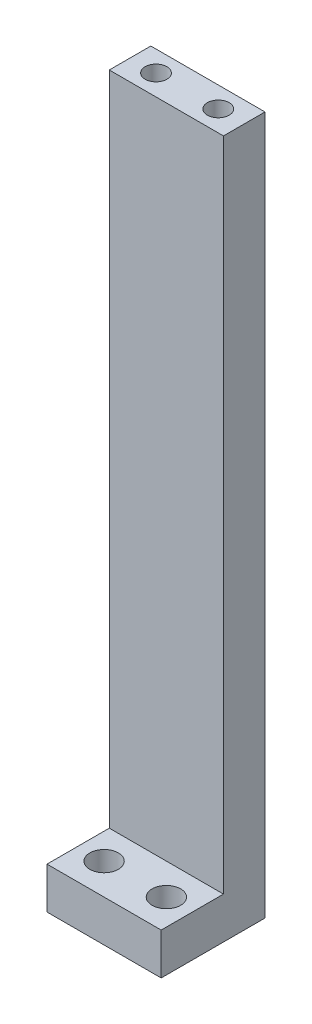
ISO-10303-21;
HEADER;
FILE_DESCRIPTION(('STEP AP214'),'2;1');
FILE_NAME('part.step','',(''),(''),'','','');
FILE_SCHEMA(('AUTOMOTIVE_DESIGN { 1 0 10303 214 1 1 1 1 }'));
ENDSEC;
DATA;
#1=APPLICATION_CONTEXT('core data for automotive mechanical design processes');
#2=APPLICATION_PROTOCOL_DEFINITION('international standard','automotive_design',2000,#1);
#3=PRODUCT_CONTEXT('',#1,'mechanical');
#4=PRODUCT('Part','Part','',(#3));
#5=PRODUCT_RELATED_PRODUCT_CATEGORY('part','',(#4));
#6=PRODUCT_DEFINITION_FORMATION('','',#4);
#7=PRODUCT_DEFINITION_CONTEXT('part definition',#1,'design');
#8=PRODUCT_DEFINITION('design','',#6,#7);
#9=PRODUCT_DEFINITION_SHAPE('','',#8);
#10=(LENGTH_UNIT() NAMED_UNIT(*) SI_UNIT(.MILLI.,.METRE.));
#11=(NAMED_UNIT(*) PLANE_ANGLE_UNIT() SI_UNIT($,.RADIAN.));
#12=(NAMED_UNIT(*) SI_UNIT($,.STERADIAN.) SOLID_ANGLE_UNIT());
#13=UNCERTAINTY_MEASURE_WITH_UNIT(LENGTH_MEASURE(1.E-05),#10,'distance_accuracy_value','');
#14=(GEOMETRIC_REPRESENTATION_CONTEXT(3) GLOBAL_UNCERTAINTY_ASSIGNED_CONTEXT((#13)) GLOBAL_UNIT_ASSIGNED_CONTEXT((#10,
#11,#12)) REPRESENTATION_CONTEXT('',''));
#15=CARTESIAN_POINT('',(0.,0.,0.));
#16=DIRECTION('',(0.,0.,1.));
#17=DIRECTION('',(1.,0.,0.));
#18=AXIS2_PLACEMENT_3D('',#15,#16,#17);
#19=CARTESIAN_POINT('',(0.,0.,8.));
#20=DIRECTION('',(0.,0.,-1.));
#21=DIRECTION('',(-1.,0.,0.));
#22=AXIS2_PLACEMENT_3D('',#19,#20,#21);
#23=PLANE('',#22);
#24=DIRECTION('',(-1.,0.,0.));
#25=VECTOR('',#24,1.);
#26=CARTESIAN_POINT('',(0.,8.,8.));
#27=LINE('',#26,#25);
#28=CARTESIAN_POINT('',(22.,8.,8.));
#29=VERTEX_POINT('',#28);
#30=CARTESIAN_POINT('',(0.,8.,8.));
#31=VERTEX_POINT('',#30);
#32=EDGE_CURVE('E54',#29,#31,#27,.T.);
#33=ORIENTED_EDGE('',*,*,#32,.F.);
#34=DIRECTION('',(0.,1.,0.));
#35=VECTOR('',#34,1.);
#36=CARTESIAN_POINT('',(22.,0.,8.));
#37=LINE('',#36,#35);
#38=CARTESIAN_POINT('',(22.,134.5,8.));
#39=VERTEX_POINT('',#38);
#40=EDGE_CURVE('E155',#29,#39,#37,.T.);
#41=ORIENTED_EDGE('',*,*,#40,.T.);
#42=DIRECTION('',(-1.,0.,0.));
#43=VECTOR('',#42,1.);
#44=CARTESIAN_POINT('',(0.,134.5,8.));
#45=LINE('',#44,#43);
#46=CARTESIAN_POINT('',(0.,134.5,8.));
#47=VERTEX_POINT('',#46);
#48=EDGE_CURVE('E60',#39,#47,#45,.T.);
#49=ORIENTED_EDGE('',*,*,#48,.T.);
#50=DIRECTION('',(0.,-1.,0.));
#51=VECTOR('',#50,1.);
#52=CARTESIAN_POINT('',(0.,0.,8.));
#53=LINE('',#52,#51);
#54=EDGE_CURVE('E89',#47,#31,#53,.T.);
#55=ORIENTED_EDGE('',*,*,#54,.T.);
#56=EDGE_LOOP('',(#33,#41,#49,#55));
#57=FACE_BOUND('',#56,.T.);
#58=ADVANCED_FACE('F39',(#57),#23,.F.);
#59=CARTESIAN_POINT('',(0.,0.,8.));
#60=DIRECTION('',(1.,0.,0.));
#61=DIRECTION('',(0.,0.,-1.));
#62=AXIS2_PLACEMENT_3D('',#59,#60,#61);
#63=PLANE('',#62);
#64=DIRECTION('',(0.,-1.,0.));
#65=VECTOR('',#64,1.);
#66=CARTESIAN_POINT('',(0.,0.,0.));
#67=LINE('',#66,#65);
#68=CARTESIAN_POINT('',(0.,134.5,0.));
#69=VERTEX_POINT('',#68);
#70=CARTESIAN_POINT('',(0.,0.,0.));
#71=VERTEX_POINT('',#70);
#72=EDGE_CURVE('E95',#69,#71,#67,.T.);
#73=ORIENTED_EDGE('',*,*,#72,.T.);
#74=DIRECTION('',(0.,0.,-1.));
#75=VECTOR('',#74,1.);
#76=CARTESIAN_POINT('',(0.,0.,8.));
#77=LINE('',#76,#75);
#78=CARTESIAN_POINT('',(0.,0.,20.));
#79=VERTEX_POINT('',#78);
#80=EDGE_CURVE('E11',#79,#71,#77,.T.);
#81=ORIENTED_EDGE('',*,*,#80,.F.);
#82=DIRECTION('',(0.,-1.,0.));
#83=VECTOR('',#82,1.);
#84=CARTESIAN_POINT('',(0.,0.,20.));
#85=LINE('',#84,#83);
#86=CARTESIAN_POINT('',(0.,8.,20.));
#87=VERTEX_POINT('',#86);
#88=EDGE_CURVE('E132',#87,#79,#85,.T.);
#89=ORIENTED_EDGE('',*,*,#88,.F.);
#90=DIRECTION('',(0.,0.,-1.));
#91=VECTOR('',#90,1.);
#92=CARTESIAN_POINT('',(0.,8.,20.));
#93=LINE('',#92,#91);
#94=EDGE_CURVE('E140',#87,#31,#93,.T.);
#95=ORIENTED_EDGE('',*,*,#94,.T.);
#96=ORIENTED_EDGE('',*,*,#54,.F.);
#97=DIRECTION('',(0.,0.,-1.));
#98=VECTOR('',#97,1.);
#99=CARTESIAN_POINT('',(0.,134.5,8.));
#100=LINE('',#99,#98);
#101=EDGE_CURVE('E82',#47,#69,#100,.T.);
#102=ORIENTED_EDGE('',*,*,#101,.T.);
#103=EDGE_LOOP('',(#73,#81,#89,#95,#96,#102));
#104=FACE_BOUND('',#103,.T.);
#105=ADVANCED_FACE('F41',(#104),#63,.F.);
#106=CARTESIAN_POINT('',(0.,0.,8.));
#107=DIRECTION('',(0.,1.,0.));
#108=DIRECTION('',(0.,0.,1.));
#109=AXIS2_PLACEMENT_3D('',#106,#107,#108);
#110=PLANE('',#109);
#111=CARTESIAN_POINT('',(17.,0.,14.));
#112=DIRECTION('',(0.,1.,0.));
#113=DIRECTION('',(0.,0.,-1.));
#114=AXIS2_PLACEMENT_3D('',#111,#112,#113);
#115=CIRCLE('',#114,2.75);
#116=CARTESIAN_POINT('',(17.,0.,11.25));
#117=VERTEX_POINT('',#116);
#118=EDGE_CURVE('E227',#117,#117,#115,.T.);
#119=ORIENTED_EDGE('',*,*,#118,.T.);
#120=EDGE_LOOP('',(#119));
#121=FACE_BOUND('',#120,.T.);
#122=CARTESIAN_POINT('',(5.,0.,14.));
#123=DIRECTION('',(0.,1.,0.));
#124=DIRECTION('',(0.,0.,1.));
#125=AXIS2_PLACEMENT_3D('',#122,#123,#124);
#126=CIRCLE('',#125,2.75);
#127=CARTESIAN_POINT('',(5.,0.,16.75));
#128=VERTEX_POINT('',#127);
#129=EDGE_CURVE('E142',#128,#128,#126,.T.);
#130=ORIENTED_EDGE('',*,*,#129,.T.);
#131=EDGE_LOOP('',(#130));
#132=FACE_BOUND('',#131,.T.);
#133=DIRECTION('',(1.,0.,0.));
#134=VECTOR('',#133,1.);
#135=CARTESIAN_POINT('',(0.,0.,0.));
#136=LINE('',#135,#134);
#137=CARTESIAN_POINT('',(22.,0.,0.));
#138=VERTEX_POINT('',#137);
#139=EDGE_CURVE('E99',#71,#138,#136,.T.);
#140=ORIENTED_EDGE('',*,*,#139,.T.);
#141=DIRECTION('',(0.,0.,-1.));
#142=VECTOR('',#141,1.);
#143=CARTESIAN_POINT('',(22.,0.,8.));
#144=LINE('',#143,#142);
#145=CARTESIAN_POINT('',(22.,0.,20.));
#146=VERTEX_POINT('',#145);
#147=EDGE_CURVE('E47',#146,#138,#144,.T.);
#148=ORIENTED_EDGE('',*,*,#147,.F.);
#149=DIRECTION('',(1.,0.,0.));
#150=VECTOR('',#149,1.);
#151=CARTESIAN_POINT('',(0.,0.,20.));
#152=LINE('',#151,#150);
#153=EDGE_CURVE('E124',#79,#146,#152,.T.);
#154=ORIENTED_EDGE('',*,*,#153,.F.);
#155=ORIENTED_EDGE('',*,*,#80,.T.);
#156=EDGE_LOOP('',(#140,#148,#154,#155));
#157=FACE_BOUND('',#156,.T.);
#158=ADVANCED_FACE('F122',(#121,#132,#157),#110,.F.);
#159=CARTESIAN_POINT('',(22.,0.,8.));
#160=DIRECTION('',(-1.,0.,0.));
#161=DIRECTION('',(0.,-1.,0.));
#162=AXIS2_PLACEMENT_3D('',#159,#160,#161);
#163=PLANE('',#162);
#164=DIRECTION('',(0.,1.,0.));
#165=VECTOR('',#164,1.);
#166=CARTESIAN_POINT('',(22.,0.,0.));
#167=LINE('',#166,#165);
#168=CARTESIAN_POINT('',(22.,134.5,0.));
#169=VERTEX_POINT('',#168);
#170=EDGE_CURVE('E90',#138,#169,#167,.T.);
#171=ORIENTED_EDGE('',*,*,#170,.T.);
#172=DIRECTION('',(0.,0.,-1.));
#173=VECTOR('',#172,1.);
#174=CARTESIAN_POINT('',(22.,134.5,8.));
#175=LINE('',#174,#173);
#176=EDGE_CURVE('E85',#39,#169,#175,.T.);
#177=ORIENTED_EDGE('',*,*,#176,.F.);
#178=ORIENTED_EDGE('',*,*,#40,.F.);
#179=DIRECTION('',(0.,0.,-1.));
#180=VECTOR('',#179,1.);
#181=CARTESIAN_POINT('',(22.,8.,20.));
#182=LINE('',#181,#180);
#183=CARTESIAN_POINT('',(22.,8.,20.));
#184=VERTEX_POINT('',#183);
#185=EDGE_CURVE('E144',#184,#29,#182,.T.);
#186=ORIENTED_EDGE('',*,*,#185,.F.);
#187=DIRECTION('',(0.,1.,0.));
#188=VECTOR('',#187,1.);
#189=CARTESIAN_POINT('',(22.,0.,20.));
#190=LINE('',#189,#188);
#191=EDGE_CURVE('E118',#146,#184,#190,.T.);
#192=ORIENTED_EDGE('',*,*,#191,.F.);
#193=ORIENTED_EDGE('',*,*,#147,.T.);
#194=EDGE_LOOP('',(#171,#177,#178,#186,#192,#193));
#195=FACE_BOUND('',#194,.T.);
#196=ADVANCED_FACE('F114',(#195),#163,.F.);
#197=CARTESIAN_POINT('',(0.,134.5,8.));
#198=DIRECTION('',(0.,-1.,0.));
#199=DIRECTION('',(0.,0.,-1.));
#200=AXIS2_PLACEMENT_3D('',#197,#198,#199);
#201=PLANE('',#200);
#202=CARTESIAN_POINT('',(17.,134.5,4.00000000000003));
#203=DIRECTION('',(0.,1.,0.));
#204=DIRECTION('',(0.,0.,1.));
#205=AXIS2_PLACEMENT_3D('',#202,#203,#204);
#206=CIRCLE('',#205,2.1);
#207=CARTESIAN_POINT('',(17.,134.5,6.10000000000003));
#208=VERTEX_POINT('',#207);
#209=EDGE_CURVE('E147',#208,#208,#206,.T.);
#210=ORIENTED_EDGE('',*,*,#209,.F.);
#211=EDGE_LOOP('',(#210));
#212=FACE_BOUND('',#211,.T.);
#213=CARTESIAN_POINT('',(4.99999999999999,134.5,4.00000000000003));
#214=DIRECTION('',(0.,1.,0.));
#215=DIRECTION('',(0.,0.,1.));
#216=AXIS2_PLACEMENT_3D('',#213,#214,#215);
#217=CIRCLE('',#216,2.1);
#218=CARTESIAN_POINT('',(4.99999999999999,134.5,6.10000000000003));
#219=VERTEX_POINT('',#218);
#220=EDGE_CURVE('E104',#219,#219,#217,.T.);
#221=ORIENTED_EDGE('',*,*,#220,.F.);
#222=EDGE_LOOP('',(#221));
#223=FACE_BOUND('',#222,.T.);
#224=DIRECTION('',(-1.,0.,0.));
#225=VECTOR('',#224,1.);
#226=CARTESIAN_POINT('',(0.,134.5,0.));
#227=LINE('',#226,#225);
#228=EDGE_CURVE('E79',#169,#69,#227,.T.);
#229=ORIENTED_EDGE('',*,*,#228,.T.);
#230=ORIENTED_EDGE('',*,*,#101,.F.);
#231=ORIENTED_EDGE('',*,*,#48,.F.);
#232=ORIENTED_EDGE('',*,*,#176,.T.);
#233=EDGE_LOOP('',(#229,#230,#231,#232));
#234=FACE_BOUND('',#233,.T.);
#235=ADVANCED_FACE('F81',(#212,#223,#234),#201,.F.);
#236=CARTESIAN_POINT('',(0.,0.,0.));
#237=DIRECTION('',(0.,0.,-1.));
#238=DIRECTION('',(-1.,0.,0.));
#239=AXIS2_PLACEMENT_3D('',#236,#237,#238);
#240=PLANE('',#239);
#241=ORIENTED_EDGE('',*,*,#72,.F.);
#242=ORIENTED_EDGE('',*,*,#228,.F.);
#243=ORIENTED_EDGE('',*,*,#170,.F.);
#244=ORIENTED_EDGE('',*,*,#139,.F.);
#245=EDGE_LOOP('',(#241,#242,#243,#244));
#246=FACE_BOUND('',#245,.T.);
#247=ADVANCED_FACE('F98',(#246),#240,.T.);
#248=CARTESIAN_POINT('',(4.99999999999999,122.1,4.00000000000003));
#249=DIRECTION('',(0.,1.,0.));
#250=DIRECTION('',(0.,0.,1.));
#251=AXIS2_PLACEMENT_3D('',#248,#249,#250);
#252=CONICAL_SURFACE('',#251,2.1,1.02974425867665);
#253=CARTESIAN_POINT('',(4.99999999999999,120.838192700042,4.00000000000003));
#254=VERTEX_POINT('',#253);
#255=VERTEX_LOOP('',#254);
#256=FACE_BOUND('',#255,.T.);
#257=CARTESIAN_POINT('',(4.99999999999999,122.1,4.00000000000003));
#258=DIRECTION('',(0.,1.,0.));
#259=DIRECTION('',(0.,0.,1.));
#260=AXIS2_PLACEMENT_3D('',#257,#258,#259);
#261=CIRCLE('',#260,2.1);
#262=CARTESIAN_POINT('',(4.99999999999999,122.1,6.10000000000003));
#263=VERTEX_POINT('',#262);
#264=EDGE_CURVE('E100',#263,#263,#261,.T.);
#265=ORIENTED_EDGE('',*,*,#264,.T.);
#266=EDGE_LOOP('',(#265));
#267=FACE_BOUND('',#266,.T.);
#268=ADVANCED_FACE('F170',(#256,#267),#252,.F.);
#269=CARTESIAN_POINT('',(4.99999999999999,134.5,4.00000000000003));
#270=DIRECTION('',(0.,1.,0.));
#271=DIRECTION('',(0.,0.,1.));
#272=AXIS2_PLACEMENT_3D('',#269,#270,#271);
#273=CYLINDRICAL_SURFACE('',#272,2.1);
#274=ORIENTED_EDGE('',*,*,#264,.F.);
#275=EDGE_LOOP('',(#274));
#276=FACE_BOUND('',#275,.T.);
#277=ORIENTED_EDGE('',*,*,#220,.T.);
#278=EDGE_LOOP('',(#277));
#279=FACE_BOUND('',#278,.T.);
#280=ADVANCED_FACE('F173',(#276,#279),#273,.F.);
#281=CARTESIAN_POINT('',(17.,122.1,4.00000000000003));
#282=DIRECTION('',(0.,1.,0.));
#283=DIRECTION('',(0.,0.,1.));
#284=AXIS2_PLACEMENT_3D('',#281,#282,#283);
#285=CONICAL_SURFACE('',#284,2.1,1.02974425867665);
#286=CARTESIAN_POINT('',(17.,120.838192700042,4.00000000000003));
#287=VERTEX_POINT('',#286);
#288=VERTEX_LOOP('',#287);
#289=FACE_BOUND('',#288,.T.);
#290=CARTESIAN_POINT('',(17.,122.1,4.00000000000003));
#291=DIRECTION('',(0.,1.,0.));
#292=DIRECTION('',(0.,0.,1.));
#293=AXIS2_PLACEMENT_3D('',#290,#291,#292);
#294=CIRCLE('',#293,2.1);
#295=CARTESIAN_POINT('',(17.,122.1,6.10000000000003));
#296=VERTEX_POINT('',#295);
#297=EDGE_CURVE('E150',#296,#296,#294,.T.);
#298=ORIENTED_EDGE('',*,*,#297,.T.);
#299=EDGE_LOOP('',(#298));
#300=FACE_BOUND('',#299,.T.);
#301=ADVANCED_FACE('F179',(#289,#300),#285,.F.);
#302=CARTESIAN_POINT('',(17.,134.5,4.00000000000003));
#303=DIRECTION('',(0.,1.,0.));
#304=DIRECTION('',(0.,0.,1.));
#305=AXIS2_PLACEMENT_3D('',#302,#303,#304);
#306=CYLINDRICAL_SURFACE('',#305,2.1);
#307=ORIENTED_EDGE('',*,*,#297,.F.);
#308=EDGE_LOOP('',(#307));
#309=FACE_BOUND('',#308,.T.);
#310=ORIENTED_EDGE('',*,*,#209,.T.);
#311=EDGE_LOOP('',(#310));
#312=FACE_BOUND('',#311,.T.);
#313=ADVANCED_FACE('F205',(#309,#312),#306,.F.);
#314=CARTESIAN_POINT('',(0.,8.,20.));
#315=DIRECTION('',(0.,-1.,0.));
#316=DIRECTION('',(0.,0.,-1.));
#317=AXIS2_PLACEMENT_3D('',#314,#315,#316);
#318=PLANE('',#317);
#319=CARTESIAN_POINT('',(17.,8.,14.));
#320=DIRECTION('',(0.,1.,0.));
#321=DIRECTION('',(0.,0.,-1.));
#322=AXIS2_PLACEMENT_3D('',#319,#320,#321);
#323=CIRCLE('',#322,2.75);
#324=CARTESIAN_POINT('',(17.,8.,11.25));
#325=VERTEX_POINT('',#324);
#326=EDGE_CURVE('E230',#325,#325,#323,.T.);
#327=ORIENTED_EDGE('',*,*,#326,.F.);
#328=EDGE_LOOP('',(#327));
#329=FACE_BOUND('',#328,.T.);
#330=CARTESIAN_POINT('',(5.,8.,14.));
#331=DIRECTION('',(0.,1.,0.));
#332=DIRECTION('',(0.,0.,1.));
#333=AXIS2_PLACEMENT_3D('',#330,#331,#332);
#334=CIRCLE('',#333,2.75);
#335=CARTESIAN_POINT('',(5.,8.,16.75));
#336=VERTEX_POINT('',#335);
#337=EDGE_CURVE('E232',#336,#336,#334,.T.);
#338=ORIENTED_EDGE('',*,*,#337,.F.);
#339=EDGE_LOOP('',(#338));
#340=FACE_BOUND('',#339,.T.);
#341=ORIENTED_EDGE('',*,*,#32,.T.);
#342=ORIENTED_EDGE('',*,*,#94,.F.);
#343=DIRECTION('',(-1.,0.,0.));
#344=VECTOR('',#343,1.);
#345=CARTESIAN_POINT('',(0.,8.,20.));
#346=LINE('',#345,#344);
#347=EDGE_CURVE('E134',#184,#87,#346,.T.);
#348=ORIENTED_EDGE('',*,*,#347,.F.);
#349=ORIENTED_EDGE('',*,*,#185,.T.);
#350=EDGE_LOOP('',(#341,#342,#348,#349));
#351=FACE_BOUND('',#350,.T.);
#352=ADVANCED_FACE('F158',(#329,#340,#351),#318,.F.);
#353=CARTESIAN_POINT('',(0.,0.,20.));
#354=DIRECTION('',(0.,0.,-1.));
#355=DIRECTION('',(-1.,0.,0.));
#356=AXIS2_PLACEMENT_3D('',#353,#354,#355);
#357=PLANE('',#356);
#358=ORIENTED_EDGE('',*,*,#88,.T.);
#359=ORIENTED_EDGE('',*,*,#153,.T.);
#360=ORIENTED_EDGE('',*,*,#191,.T.);
#361=ORIENTED_EDGE('',*,*,#347,.T.);
#362=EDGE_LOOP('',(#358,#359,#360,#361));
#363=FACE_BOUND('',#362,.T.);
#364=ADVANCED_FACE('F129',(#363),#357,.F.);
#365=CARTESIAN_POINT('',(5.,0.,14.));
#366=DIRECTION('',(0.,1.,0.));
#367=DIRECTION('',(0.,0.,1.));
#368=AXIS2_PLACEMENT_3D('',#365,#366,#367);
#369=CYLINDRICAL_SURFACE('',#368,2.75);
#370=ORIENTED_EDGE('',*,*,#129,.F.);
#371=EDGE_LOOP('',(#370));
#372=FACE_BOUND('',#371,.T.);
#373=ORIENTED_EDGE('',*,*,#337,.T.);
#374=EDGE_LOOP('',(#373));
#375=FACE_BOUND('',#374,.T.);
#376=ADVANCED_FACE('F215',(#372,#375),#369,.F.);
#377=CARTESIAN_POINT('',(17.,0.,14.));
#378=DIRECTION('',(0.,1.,0.));
#379=DIRECTION('',(0.,0.,1.));
#380=AXIS2_PLACEMENT_3D('',#377,#378,#379);
#381=CYLINDRICAL_SURFACE('',#380,2.75);
#382=ORIENTED_EDGE('',*,*,#118,.F.);
#383=EDGE_LOOP('',(#382));
#384=FACE_BOUND('',#383,.T.);
#385=ORIENTED_EDGE('',*,*,#326,.T.);
#386=EDGE_LOOP('',(#385));
#387=FACE_BOUND('',#386,.T.);
#388=ADVANCED_FACE('F218',(#384,#387),#381,.F.);
#389=CLOSED_SHELL('',(#58,#105,#158,#196,#235,#247,#268,#280,#301,#313,#352,#364,#376,#388));
#390=MANIFOLD_SOLID_BREP('B2',#389);
#391=ADVANCED_BREP_SHAPE_REPRESENTATION('',(#18,#390),#14);
#392=SHAPE_DEFINITION_REPRESENTATION(#9,#391);
ENDSEC;
END-ISO-10303-21;
